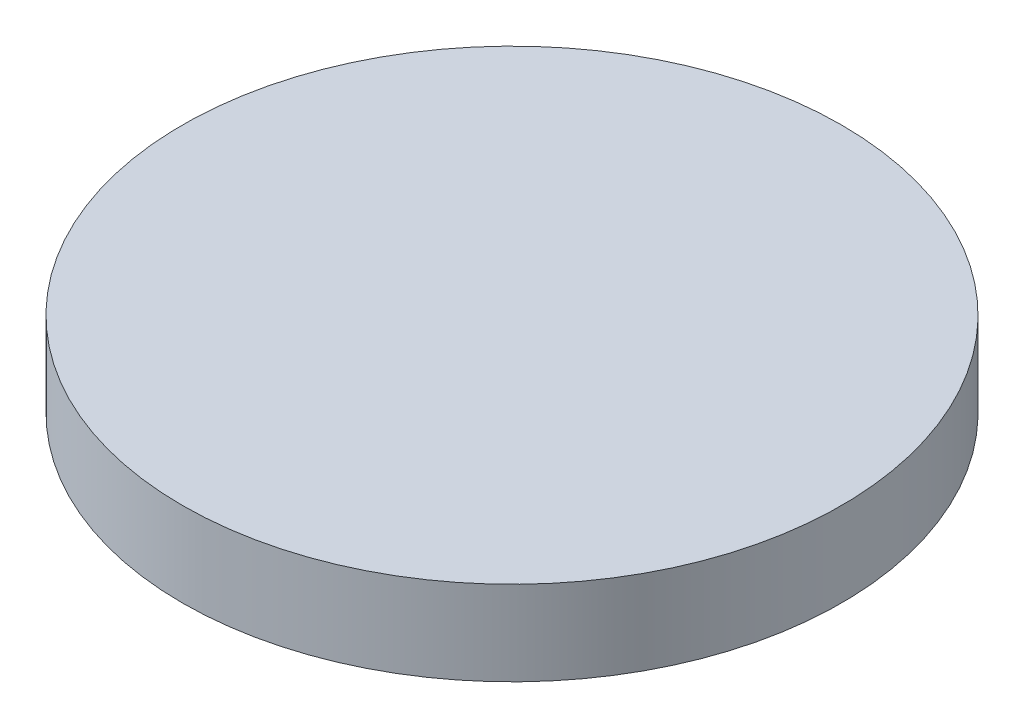
ISO-10303-21;
HEADER;
FILE_DESCRIPTION(('STEP AP214'),'2;1');
FILE_NAME('part.step','',(''),(''),'','','');
FILE_SCHEMA(('AUTOMOTIVE_DESIGN { 1 0 10303 214 1 1 1 1 }'));
ENDSEC;
DATA;
#1=APPLICATION_CONTEXT('core data for automotive mechanical design processes');
#2=APPLICATION_PROTOCOL_DEFINITION('international standard','automotive_design',2000,#1);
#3=PRODUCT_CONTEXT('',#1,'mechanical');
#4=PRODUCT('Part','Part','',(#3));
#5=PRODUCT_RELATED_PRODUCT_CATEGORY('part','',(#4));
#6=PRODUCT_DEFINITION_FORMATION('','',#4);
#7=PRODUCT_DEFINITION_CONTEXT('part definition',#1,'design');
#8=PRODUCT_DEFINITION('design','',#6,#7);
#9=PRODUCT_DEFINITION_SHAPE('','',#8);
#10=(LENGTH_UNIT() NAMED_UNIT(*) SI_UNIT(.MILLI.,.METRE.));
#11=(NAMED_UNIT(*) PLANE_ANGLE_UNIT() SI_UNIT($,.RADIAN.));
#12=(NAMED_UNIT(*) SI_UNIT($,.STERADIAN.) SOLID_ANGLE_UNIT());
#13=UNCERTAINTY_MEASURE_WITH_UNIT(LENGTH_MEASURE(1.E-05),#10,'distance_accuracy_value','');
#14=(GEOMETRIC_REPRESENTATION_CONTEXT(3) GLOBAL_UNCERTAINTY_ASSIGNED_CONTEXT((#13)) GLOBAL_UNIT_ASSIGNED_CONTEXT((#10,
#11,#12)) REPRESENTATION_CONTEXT('',''));
#15=CARTESIAN_POINT('',(0.,0.,0.));
#16=DIRECTION('',(0.,0.,1.));
#17=DIRECTION('',(1.,0.,0.));
#18=AXIS2_PLACEMENT_3D('',#15,#16,#17);
#19=CARTESIAN_POINT('',(0.,6.35,0.));
#20=DIRECTION('',(0.,-1.,0.));
#21=DIRECTION('',(0.,0.,-1.));
#22=AXIS2_PLACEMENT_3D('',#19,#20,#21);
#23=CYLINDRICAL_SURFACE('',#22,24.765);
#24=CARTESIAN_POINT('',(0.,6.35,0.));
#25=DIRECTION('',(0.,1.,0.));
#26=DIRECTION('',(0.,0.,1.));
#27=AXIS2_PLACEMENT_3D('',#24,#25,#26);
#28=CIRCLE('',#27,24.765);
#29=CARTESIAN_POINT('',(0.,6.35,24.765));
#30=VERTEX_POINT('',#29);
#31=EDGE_CURVE('E10',#30,#30,#28,.T.);
#32=ORIENTED_EDGE('',*,*,#31,.F.);
#33=EDGE_LOOP('',(#32));
#34=FACE_BOUND('',#33,.T.);
#35=CARTESIAN_POINT('',(0.,0.,0.));
#36=DIRECTION('',(0.,1.,0.));
#37=DIRECTION('',(0.,0.,1.));
#38=AXIS2_PLACEMENT_3D('',#35,#36,#37);
#39=CIRCLE('',#38,24.765);
#40=CARTESIAN_POINT('',(0.,0.,24.765));
#41=VERTEX_POINT('',#40);
#42=EDGE_CURVE('E34',#41,#41,#39,.T.);
#43=ORIENTED_EDGE('',*,*,#42,.T.);
#44=EDGE_LOOP('',(#43));
#45=FACE_BOUND('',#44,.T.);
#46=ADVANCED_FACE('F31',(#34,#45),#23,.T.);
#47=CARTESIAN_POINT('',(0.,6.35,0.));
#48=DIRECTION('',(0.,1.,0.));
#49=DIRECTION('',(0.,0.,1.));
#50=AXIS2_PLACEMENT_3D('',#47,#48,#49);
#51=PLANE('',#50);
#52=ORIENTED_EDGE('',*,*,#31,.T.);
#53=EDGE_LOOP('',(#52));
#54=FACE_BOUND('',#53,.T.);
#55=ADVANCED_FACE('F46',(#54),#51,.T.);
#56=CARTESIAN_POINT('',(0.,0.,0.));
#57=DIRECTION('',(0.,1.,0.));
#58=DIRECTION('',(0.,0.,1.));
#59=AXIS2_PLACEMENT_3D('',#56,#57,#58);
#60=PLANE('',#59);
#61=ORIENTED_EDGE('',*,*,#42,.F.);
#62=EDGE_LOOP('',(#61));
#63=FACE_BOUND('',#62,.T.);
#64=ADVANCED_FACE('F44',(#63),#60,.F.);
#65=CLOSED_SHELL('',(#46,#55,#64));
#66=MANIFOLD_SOLID_BREP('B2',#65);
#67=ADVANCED_BREP_SHAPE_REPRESENTATION('',(#18,#66),#14);
#68=SHAPE_DEFINITION_REPRESENTATION(#9,#67);
ENDSEC;
END-ISO-10303-21;
